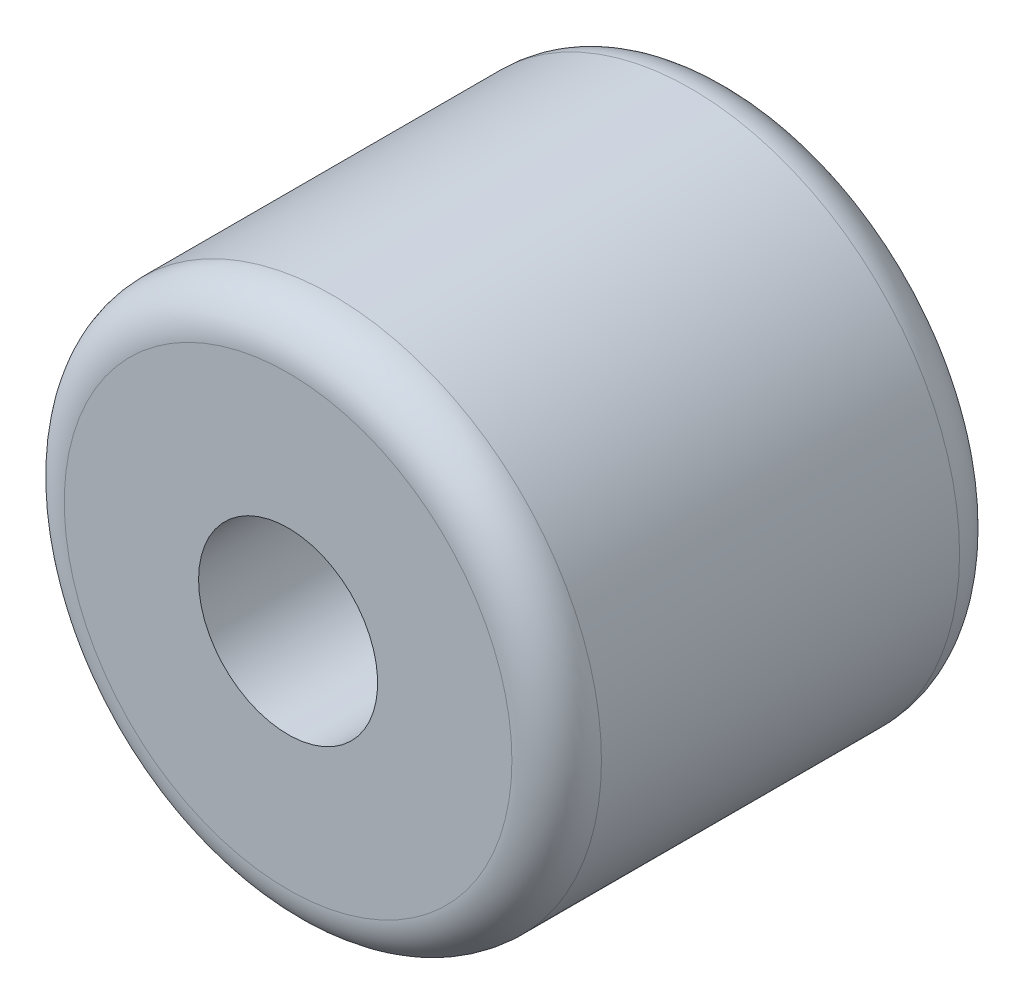
ISO-10303-21;
HEADER;
FILE_DESCRIPTION(('STEP AP214'),'2;1');
FILE_NAME('part.step','',(''),(''),'','','');
FILE_SCHEMA(('AUTOMOTIVE_DESIGN { 1 0 10303 214 1 1 1 1 }'));
ENDSEC;
DATA;
#1=APPLICATION_CONTEXT('core data for automotive mechanical design processes');
#2=APPLICATION_PROTOCOL_DEFINITION('international standard','automotive_design',2000,#1);
#3=PRODUCT_CONTEXT('',#1,'mechanical');
#4=PRODUCT('Part','Part','',(#3));
#5=PRODUCT_RELATED_PRODUCT_CATEGORY('part','',(#4));
#6=PRODUCT_DEFINITION_FORMATION('','',#4);
#7=PRODUCT_DEFINITION_CONTEXT('part definition',#1,'design');
#8=PRODUCT_DEFINITION('design','',#6,#7);
#9=PRODUCT_DEFINITION_SHAPE('','',#8);
#10=(LENGTH_UNIT() NAMED_UNIT(*) SI_UNIT(.MILLI.,.METRE.));
#11=(NAMED_UNIT(*) PLANE_ANGLE_UNIT() SI_UNIT($,.RADIAN.));
#12=(NAMED_UNIT(*) SI_UNIT($,.STERADIAN.) SOLID_ANGLE_UNIT());
#13=UNCERTAINTY_MEASURE_WITH_UNIT(LENGTH_MEASURE(1.E-05),#10,'distance_accuracy_value','');
#14=(GEOMETRIC_REPRESENTATION_CONTEXT(3) GLOBAL_UNCERTAINTY_ASSIGNED_CONTEXT((#13)) GLOBAL_UNIT_ASSIGNED_CONTEXT((#10,
#11,#12)) REPRESENTATION_CONTEXT('',''));
#15=CARTESIAN_POINT('',(0.,0.,0.));
#16=DIRECTION('',(0.,0.,1.));
#17=DIRECTION('',(1.,0.,0.));
#18=AXIS2_PLACEMENT_3D('',#15,#16,#17);
#19=CARTESIAN_POINT('',(0.,0.,10.));
#20=DIRECTION('',(0.,0.,-1.));
#21=DIRECTION('',(-1.,0.,0.));
#22=AXIS2_PLACEMENT_3D('',#19,#20,#21);
#23=CYLINDRICAL_SURFACE('',#22,6.);
#24=CARTESIAN_POINT('',(0.,0.,0.999999999999999));
#25=DIRECTION('',(0.,0.,1.));
#26=DIRECTION('',(1.,0.,0.));
#27=AXIS2_PLACEMENT_3D('',#24,#25,#26);
#28=CIRCLE('',#27,6.);
#29=CARTESIAN_POINT('',(6.,0.,0.999999999999999));
#30=VERTEX_POINT('',#29);
#31=EDGE_CURVE('E46',#30,#30,#28,.T.);
#32=ORIENTED_EDGE('',*,*,#31,.T.);
#33=EDGE_LOOP('',(#32));
#34=FACE_BOUND('',#33,.T.);
#35=CARTESIAN_POINT('',(0.,0.,9.));
#36=DIRECTION('',(0.,0.,1.));
#37=DIRECTION('',(1.,0.,0.));
#38=AXIS2_PLACEMENT_3D('',#35,#36,#37);
#39=CIRCLE('',#38,6.);
#40=CARTESIAN_POINT('',(6.,0.,9.));
#41=VERTEX_POINT('',#40);
#42=EDGE_CURVE('E50',#41,#41,#39,.F.);
#43=ORIENTED_EDGE('',*,*,#42,.T.);
#44=EDGE_LOOP('',(#43));
#45=FACE_BOUND('',#44,.T.);
#46=ADVANCED_FACE('F35',(#34,#45),#23,.T.);
#47=CARTESIAN_POINT('',(0.,0.,10.));
#48=DIRECTION('',(0.,0.,1.));
#49=DIRECTION('',(1.,0.,0.));
#50=AXIS2_PLACEMENT_3D('',#47,#48,#49);
#51=PLANE('',#50);
#52=CARTESIAN_POINT('',(0.,0.,10.));
#53=DIRECTION('',(0.,0.,1.));
#54=DIRECTION('',(1.,0.,0.));
#55=AXIS2_PLACEMENT_3D('',#52,#53,#54);
#56=CIRCLE('',#55,5.);
#57=CARTESIAN_POINT('',(5.,0.,10.));
#58=VERTEX_POINT('',#57);
#59=EDGE_CURVE('E10',#58,#58,#56,.T.);
#60=ORIENTED_EDGE('',*,*,#59,.T.);
#61=EDGE_LOOP('',(#60));
#62=FACE_BOUND('',#61,.T.);
#63=CARTESIAN_POINT('',(0.,0.,10.));
#64=DIRECTION('',(0.,0.,-1.));
#65=DIRECTION('',(-1.,0.,0.));
#66=AXIS2_PLACEMENT_3D('',#63,#64,#65);
#67=CIRCLE('',#66,2.);
#68=CARTESIAN_POINT('',(-2.,0.,10.));
#69=VERTEX_POINT('',#68);
#70=EDGE_CURVE('E55',#69,#69,#67,.T.);
#71=ORIENTED_EDGE('',*,*,#70,.T.);
#72=EDGE_LOOP('',(#71));
#73=FACE_BOUND('',#72,.T.);
#74=ADVANCED_FACE('F62',(#62,#73),#51,.T.);
#75=CARTESIAN_POINT('',(0.,0.,0.));
#76=DIRECTION('',(0.,0.,1.));
#77=DIRECTION('',(1.,0.,0.));
#78=AXIS2_PLACEMENT_3D('',#75,#76,#77);
#79=PLANE('',#78);
#80=CARTESIAN_POINT('',(0.,0.,0.));
#81=DIRECTION('',(0.,0.,1.));
#82=DIRECTION('',(1.,0.,0.));
#83=AXIS2_PLACEMENT_3D('',#80,#81,#82);
#84=CIRCLE('',#83,5.);
#85=CARTESIAN_POINT('',(5.,0.,0.));
#86=VERTEX_POINT('',#85);
#87=EDGE_CURVE('E42',#86,#86,#84,.F.);
#88=ORIENTED_EDGE('',*,*,#87,.T.);
#89=EDGE_LOOP('',(#88));
#90=FACE_BOUND('',#89,.T.);
#91=CARTESIAN_POINT('',(0.,0.,0.));
#92=DIRECTION('',(0.,0.,-1.));
#93=DIRECTION('',(-1.,0.,0.));
#94=AXIS2_PLACEMENT_3D('',#91,#92,#93);
#95=CIRCLE('',#94,2.);
#96=CARTESIAN_POINT('',(-2.,0.,0.));
#97=VERTEX_POINT('',#96);
#98=EDGE_CURVE('E56',#97,#97,#95,.T.);
#99=ORIENTED_EDGE('',*,*,#98,.F.);
#100=EDGE_LOOP('',(#99));
#101=FACE_BOUND('',#100,.T.);
#102=ADVANCED_FACE('F68',(#90,#101),#79,.F.);
#103=CARTESIAN_POINT('',(0.,0.,10.));
#104=DIRECTION('',(0.,0.,-1.));
#105=DIRECTION('',(-1.,0.,0.));
#106=AXIS2_PLACEMENT_3D('',#103,#104,#105);
#107=CYLINDRICAL_SURFACE('',#106,2.);
#108=ORIENTED_EDGE('',*,*,#70,.F.);
#109=EDGE_LOOP('',(#108));
#110=FACE_BOUND('',#109,.T.);
#111=ORIENTED_EDGE('',*,*,#98,.T.);
#112=EDGE_LOOP('',(#111));
#113=FACE_BOUND('',#112,.T.);
#114=ADVANCED_FACE('F64',(#110,#113),#107,.F.);
#115=CARTESIAN_POINT('',(0.,0.,0.999999999999999));
#116=DIRECTION('',(0.,0.,1.));
#117=DIRECTION('',(1.,0.,0.));
#118=AXIS2_PLACEMENT_3D('',#115,#116,#117);
#119=TOROIDAL_SURFACE('',#118,5.,1.);
#120=ORIENTED_EDGE('',*,*,#87,.F.);
#121=EDGE_LOOP('',(#120));
#122=FACE_BOUND('',#121,.T.);
#123=ORIENTED_EDGE('',*,*,#31,.F.);
#124=EDGE_LOOP('',(#123));
#125=FACE_BOUND('',#124,.T.);
#126=ADVANCED_FACE('F67',(#122,#125),#119,.T.);
#127=CARTESIAN_POINT('',(0.,0.,9.));
#128=DIRECTION('',(0.,0.,1.));
#129=DIRECTION('',(1.,0.,0.));
#130=AXIS2_PLACEMENT_3D('',#127,#128,#129);
#131=TOROIDAL_SURFACE('',#130,5.,1.);
#132=ORIENTED_EDGE('',*,*,#42,.F.);
#133=EDGE_LOOP('',(#132));
#134=FACE_BOUND('',#133,.T.);
#135=ORIENTED_EDGE('',*,*,#59,.F.);
#136=EDGE_LOOP('',(#135));
#137=FACE_BOUND('',#136,.T.);
#138=ADVANCED_FACE('F37',(#134,#137),#131,.T.);
#139=CLOSED_SHELL('',(#46,#74,#102,#114,#126,#138));
#140=MANIFOLD_SOLID_BREP('B2',#139);
#141=ADVANCED_BREP_SHAPE_REPRESENTATION('',(#18,#140),#14);
#142=SHAPE_DEFINITION_REPRESENTATION(#9,#141);
ENDSEC;
END-ISO-10303-21;
